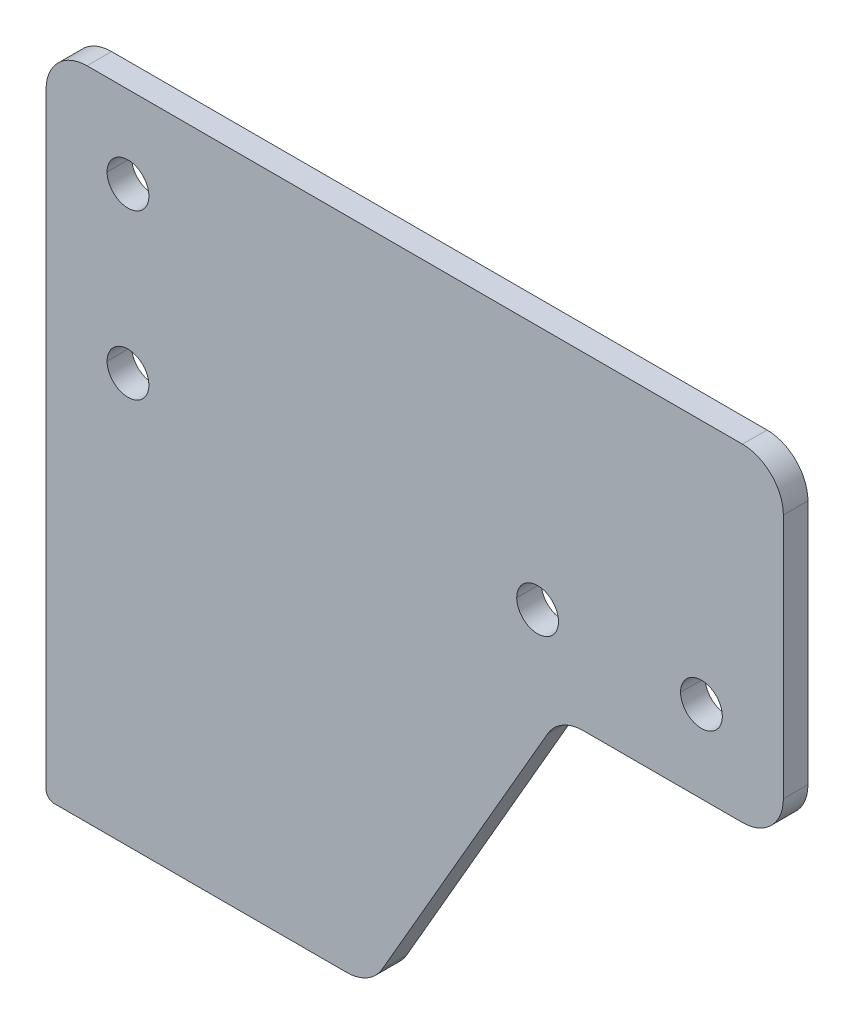
ISO-10303-21;
HEADER;
FILE_DESCRIPTION(('STEP AP214'),'2;1');
FILE_NAME('part.step','',(''),(''),'','','');
FILE_SCHEMA(('AUTOMOTIVE_DESIGN { 1 0 10303 214 1 1 1 1 }'));
ENDSEC;
DATA;
#1=APPLICATION_CONTEXT('core data for automotive mechanical design processes');
#2=APPLICATION_PROTOCOL_DEFINITION('international standard','automotive_design',2000,#1);
#3=PRODUCT_CONTEXT('',#1,'mechanical');
#4=PRODUCT('Part','Part','',(#3));
#5=PRODUCT_RELATED_PRODUCT_CATEGORY('part','',(#4));
#6=PRODUCT_DEFINITION_FORMATION('','',#4);
#7=PRODUCT_DEFINITION_CONTEXT('part definition',#1,'design');
#8=PRODUCT_DEFINITION('design','',#6,#7);
#9=PRODUCT_DEFINITION_SHAPE('','',#8);
#10=(LENGTH_UNIT() NAMED_UNIT(*) SI_UNIT(.MILLI.,.METRE.));
#11=(NAMED_UNIT(*) PLANE_ANGLE_UNIT() SI_UNIT($,.RADIAN.));
#12=(NAMED_UNIT(*) SI_UNIT($,.STERADIAN.) SOLID_ANGLE_UNIT());
#13=UNCERTAINTY_MEASURE_WITH_UNIT(LENGTH_MEASURE(1.E-05),#10,'distance_accuracy_value','');
#14=(GEOMETRIC_REPRESENTATION_CONTEXT(3) GLOBAL_UNCERTAINTY_ASSIGNED_CONTEXT((#13)) GLOBAL_UNIT_ASSIGNED_CONTEXT((#10,
#11,#12)) REPRESENTATION_CONTEXT('',''));
#15=CARTESIAN_POINT('',(0.,0.,0.));
#16=DIRECTION('',(0.,0.,1.));
#17=DIRECTION('',(1.,0.,0.));
#18=AXIS2_PLACEMENT_3D('',#15,#16,#17);
#19=CARTESIAN_POINT('',(35.,-111.435775775645,3.));
#20=DIRECTION('',(0.,0.,-1.));
#21=DIRECTION('',(-1.,0.,0.));
#22=AXIS2_PLACEMENT_3D('',#19,#20,#21);
#23=CYLINDRICAL_SURFACE('',#22,2.55);
#24=DIRECTION('',(0.,0.,-1.));
#25=VECTOR('',#24,1.);
#26=CARTESIAN_POINT('',(37.55,-111.435775775645,3.));
#27=LINE('',#26,#25);
#28=CARTESIAN_POINT('',(37.55,-111.435775775645,3.));
#29=VERTEX_POINT('',#28);
#30=CARTESIAN_POINT('',(37.55,-111.435775775645,0.));
#31=VERTEX_POINT('',#30);
#32=EDGE_CURVE('E461',#29,#31,#27,.T.);
#33=ORIENTED_EDGE('',*,*,#32,.F.);
#34=CARTESIAN_POINT('',(35.,-111.435775775645,3.));
#35=DIRECTION('',(0.,0.,1.));
#36=DIRECTION('',(-1.,0.,0.));
#37=AXIS2_PLACEMENT_3D('',#34,#35,#36);
#38=CIRCLE('',#37,2.55);
#39=CARTESIAN_POINT('',(32.45,-111.435775775645,3.));
#40=VERTEX_POINT('',#39);
#41=EDGE_CURVE('E323',#29,#40,#38,.T.);
#42=ORIENTED_EDGE('',*,*,#41,.T.);
#43=DIRECTION('',(0.,0.,-1.));
#44=VECTOR('',#43,1.);
#45=CARTESIAN_POINT('',(32.45,-111.435775775645,3.));
#46=LINE('',#45,#44);
#47=CARTESIAN_POINT('',(32.45,-111.435775775645,0.));
#48=VERTEX_POINT('',#47);
#49=EDGE_CURVE('E241',#40,#48,#46,.T.);
#50=ORIENTED_EDGE('',*,*,#49,.T.);
#51=CARTESIAN_POINT('',(35.,-111.435775775645,0.));
#52=DIRECTION('',(0.,0.,1.));
#53=DIRECTION('',(-1.,0.,0.));
#54=AXIS2_PLACEMENT_3D('',#51,#52,#53);
#55=CIRCLE('',#54,2.55);
#56=EDGE_CURVE('E360',#31,#48,#55,.T.);
#57=ORIENTED_EDGE('',*,*,#56,.F.);
#58=EDGE_LOOP('',(#33,#42,#50,#57));
#59=FACE_BOUND('',#58,.T.);
#60=ADVANCED_FACE('F17',(#59),#23,.F.);
#61=CARTESIAN_POINT('',(15.,-111.435775775645,3.));
#62=DIRECTION('',(0.,0.,-1.));
#63=DIRECTION('',(-1.,0.,0.));
#64=AXIS2_PLACEMENT_3D('',#61,#62,#63);
#65=CYLINDRICAL_SURFACE('',#64,2.55);
#66=DIRECTION('',(0.,0.,-1.));
#67=VECTOR('',#66,1.);
#68=CARTESIAN_POINT('',(17.55,-111.435775775645,3.));
#69=LINE('',#68,#67);
#70=CARTESIAN_POINT('',(17.55,-111.435775775645,3.));
#71=VERTEX_POINT('',#70);
#72=CARTESIAN_POINT('',(17.55,-111.435775775645,0.));
#73=VERTEX_POINT('',#72);
#74=EDGE_CURVE('E253',#71,#73,#69,.T.);
#75=ORIENTED_EDGE('',*,*,#74,.F.);
#76=CARTESIAN_POINT('',(15.,-111.435775775645,3.));
#77=DIRECTION('',(0.,0.,1.));
#78=DIRECTION('',(-1.,0.,0.));
#79=AXIS2_PLACEMENT_3D('',#76,#77,#78);
#80=CIRCLE('',#79,2.55);
#81=CARTESIAN_POINT('',(12.45,-111.435775775645,3.));
#82=VERTEX_POINT('',#81);
#83=EDGE_CURVE('E213',#71,#82,#80,.T.);
#84=ORIENTED_EDGE('',*,*,#83,.T.);
#85=DIRECTION('',(0.,0.,-1.));
#86=VECTOR('',#85,1.);
#87=CARTESIAN_POINT('',(12.45,-111.435775775645,3.));
#88=LINE('',#87,#86);
#89=CARTESIAN_POINT('',(12.45,-111.435775775645,0.));
#90=VERTEX_POINT('',#89);
#91=EDGE_CURVE('E265',#82,#90,#88,.T.);
#92=ORIENTED_EDGE('',*,*,#91,.T.);
#93=CARTESIAN_POINT('',(15.,-111.435775775645,0.));
#94=DIRECTION('',(0.,0.,1.));
#95=DIRECTION('',(-1.,0.,0.));
#96=AXIS2_PLACEMENT_3D('',#93,#94,#95);
#97=CIRCLE('',#96,2.55);
#98=EDGE_CURVE('E381',#73,#90,#97,.T.);
#99=ORIENTED_EDGE('',*,*,#98,.F.);
#100=EDGE_LOOP('',(#75,#84,#92,#99));
#101=FACE_BOUND('',#100,.T.);
#102=ADVANCED_FACE('F503',(#101),#65,.F.);
#103=CARTESIAN_POINT('',(-35.,-91.4357757756449,3.));
#104=DIRECTION('',(0.,0.,-1.));
#105=DIRECTION('',(-1.,0.,0.));
#106=AXIS2_PLACEMENT_3D('',#103,#104,#105);
#107=CYLINDRICAL_SURFACE('',#106,2.55);
#108=DIRECTION('',(0.,0.,-1.));
#109=VECTOR('',#108,1.);
#110=CARTESIAN_POINT('',(-32.45,-91.4357757756449,3.));
#111=LINE('',#110,#109);
#112=CARTESIAN_POINT('',(-32.45,-91.4357757756449,3.));
#113=VERTEX_POINT('',#112);
#114=CARTESIAN_POINT('',(-32.45,-91.4357757756449,0.));
#115=VERTEX_POINT('',#114);
#116=EDGE_CURVE('E264',#113,#115,#111,.T.);
#117=ORIENTED_EDGE('',*,*,#116,.F.);
#118=CARTESIAN_POINT('',(-35.,-91.4357757756449,3.));
#119=DIRECTION('',(0.,0.,1.));
#120=DIRECTION('',(-1.,0.,0.));
#121=AXIS2_PLACEMENT_3D('',#118,#119,#120);
#122=CIRCLE('',#121,2.55);
#123=CARTESIAN_POINT('',(-37.55,-91.4357757756449,3.));
#124=VERTEX_POINT('',#123);
#125=EDGE_CURVE('E212',#113,#124,#122,.T.);
#126=ORIENTED_EDGE('',*,*,#125,.T.);
#127=DIRECTION('',(0.,0.,-1.));
#128=VECTOR('',#127,1.);
#129=CARTESIAN_POINT('',(-37.55,-91.4357757756449,3.));
#130=LINE('',#129,#128);
#131=CARTESIAN_POINT('',(-37.55,-91.4357757756449,0.));
#132=VERTEX_POINT('',#131);
#133=EDGE_CURVE('E228',#124,#132,#130,.T.);
#134=ORIENTED_EDGE('',*,*,#133,.T.);
#135=CARTESIAN_POINT('',(-35.,-91.4357757756449,0.));
#136=DIRECTION('',(0.,0.,1.));
#137=DIRECTION('',(-1.,0.,0.));
#138=AXIS2_PLACEMENT_3D('',#135,#136,#137);
#139=CIRCLE('',#138,2.55);
#140=EDGE_CURVE('E364',#115,#132,#139,.T.);
#141=ORIENTED_EDGE('',*,*,#140,.F.);
#142=EDGE_LOOP('',(#117,#126,#134,#141));
#143=FACE_BOUND('',#142,.T.);
#144=ADVANCED_FACE('F490',(#143),#107,.F.);
#145=CARTESIAN_POINT('',(-35.,-111.435775775645,3.));
#146=DIRECTION('',(0.,0.,-1.));
#147=DIRECTION('',(-1.,0.,0.));
#148=AXIS2_PLACEMENT_3D('',#145,#146,#147);
#149=CYLINDRICAL_SURFACE('',#148,2.55);
#150=DIRECTION('',(0.,0.,-1.));
#151=VECTOR('',#150,1.);
#152=CARTESIAN_POINT('',(-32.45,-111.435775775645,3.));
#153=LINE('',#152,#151);
#154=CARTESIAN_POINT('',(-32.45,-111.435775775645,3.));
#155=VERTEX_POINT('',#154);
#156=CARTESIAN_POINT('',(-32.45,-111.435775775645,0.));
#157=VERTEX_POINT('',#156);
#158=EDGE_CURVE('E216',#155,#157,#153,.T.);
#159=ORIENTED_EDGE('',*,*,#158,.F.);
#160=CARTESIAN_POINT('',(-35.,-111.435775775645,3.));
#161=DIRECTION('',(0.,0.,1.));
#162=DIRECTION('',(-1.,0.,0.));
#163=AXIS2_PLACEMENT_3D('',#160,#161,#162);
#164=CIRCLE('',#163,2.55);
#165=CARTESIAN_POINT('',(-37.55,-111.435775775645,3.));
#166=VERTEX_POINT('',#165);
#167=EDGE_CURVE('E202',#155,#166,#164,.T.);
#168=ORIENTED_EDGE('',*,*,#167,.T.);
#169=DIRECTION('',(0.,0.,-1.));
#170=VECTOR('',#169,1.);
#171=CARTESIAN_POINT('',(-37.55,-111.435775775645,3.));
#172=LINE('',#171,#170);
#173=CARTESIAN_POINT('',(-37.55,-111.435775775645,0.));
#174=VERTEX_POINT('',#173);
#175=EDGE_CURVE('E226',#166,#174,#172,.T.);
#176=ORIENTED_EDGE('',*,*,#175,.T.);
#177=CARTESIAN_POINT('',(-35.,-111.435775775645,0.));
#178=DIRECTION('',(0.,0.,1.));
#179=DIRECTION('',(-1.,0.,0.));
#180=AXIS2_PLACEMENT_3D('',#177,#178,#179);
#181=CIRCLE('',#180,2.55);
#182=EDGE_CURVE('E218',#157,#174,#181,.T.);
#183=ORIENTED_EDGE('',*,*,#182,.F.);
#184=EDGE_LOOP('',(#159,#168,#176,#183));
#185=FACE_BOUND('',#184,.T.);
#186=ADVANCED_FACE('F217',(#185),#149,.F.);
#187=CARTESIAN_POINT('',(40.,-81.4357757756449,3.));
#188=DIRECTION('',(0.,-1.,0.));
#189=DIRECTION('',(-1.,0.,0.));
#190=AXIS2_PLACEMENT_3D('',#187,#188,#189);
#191=PLANE('',#190);
#192=DIRECTION('',(-1.,0.,0.));
#193=VECTOR('',#192,1.);
#194=CARTESIAN_POINT('',(40.,-81.4357757756449,0.));
#195=LINE('',#194,#193);
#196=CARTESIAN_POINT('',(40.,-81.4357757756449,0.));
#197=VERTEX_POINT('',#196);
#198=CARTESIAN_POINT('',(-40.,-81.4357757756449,0.));
#199=VERTEX_POINT('',#198);
#200=EDGE_CURVE('E336',#197,#199,#195,.T.);
#201=ORIENTED_EDGE('',*,*,#200,.T.);
#202=DIRECTION('',(0.,0.,-1.));
#203=VECTOR('',#202,1.);
#204=CARTESIAN_POINT('',(-40.,-81.4357757756449,3.));
#205=LINE('',#204,#203);
#206=CARTESIAN_POINT('',(-40.,-81.4357757756449,3.));
#207=VERTEX_POINT('',#206);
#208=EDGE_CURVE('E388',#207,#199,#205,.T.);
#209=ORIENTED_EDGE('',*,*,#208,.F.);
#210=DIRECTION('',(-1.,0.,0.));
#211=VECTOR('',#210,1.);
#212=CARTESIAN_POINT('',(40.,-81.4357757756449,3.));
#213=LINE('',#212,#211);
#214=CARTESIAN_POINT('',(40.,-81.4357757756449,3.));
#215=VERTEX_POINT('',#214);
#216=EDGE_CURVE('E315',#215,#207,#213,.T.);
#217=ORIENTED_EDGE('',*,*,#216,.F.);
#218=DIRECTION('',(0.,0.,-1.));
#219=VECTOR('',#218,1.);
#220=CARTESIAN_POINT('',(40.,-81.4357757756449,3.));
#221=LINE('',#220,#219);
#222=EDGE_CURVE('E11',#215,#197,#221,.T.);
#223=ORIENTED_EDGE('',*,*,#222,.T.);
#224=EDGE_LOOP('',(#201,#209,#217,#223));
#225=FACE_BOUND('',#224,.T.);
#226=ADVANCED_FACE('F514',(#225),#191,.F.);
#227=CARTESIAN_POINT('',(40.,-86.4357757756449,3.));
#228=DIRECTION('',(0.,0.,-1.));
#229=DIRECTION('',(-1.,0.,0.));
#230=AXIS2_PLACEMENT_3D('',#227,#228,#229);
#231=CYLINDRICAL_SURFACE('',#230,5.);
#232=CARTESIAN_POINT('',(40.,-86.4357757756449,0.));
#233=DIRECTION('',(0.,0.,1.));
#234=DIRECTION('',(1.,0.,0.));
#235=AXIS2_PLACEMENT_3D('',#232,#233,#234);
#236=CIRCLE('',#235,5.);
#237=CARTESIAN_POINT('',(45.,-86.435775775645,0.));
#238=VERTEX_POINT('',#237);
#239=EDGE_CURVE('E340',#238,#197,#236,.T.);
#240=ORIENTED_EDGE('',*,*,#239,.T.);
#241=ORIENTED_EDGE('',*,*,#222,.F.);
#242=CARTESIAN_POINT('',(40.,-86.4357757756449,3.));
#243=DIRECTION('',(0.,0.,1.));
#244=DIRECTION('',(1.,0.,0.));
#245=AXIS2_PLACEMENT_3D('',#242,#243,#244);
#246=CIRCLE('',#245,5.);
#247=CARTESIAN_POINT('',(45.,-86.435775775645,3.));
#248=VERTEX_POINT('',#247);
#249=EDGE_CURVE('E311',#248,#215,#246,.T.);
#250=ORIENTED_EDGE('',*,*,#249,.F.);
#251=DIRECTION('',(0.,0.,-1.));
#252=VECTOR('',#251,1.);
#253=CARTESIAN_POINT('',(45.,-86.435775775645,3.));
#254=LINE('',#253,#252);
#255=EDGE_CURVE('E25',#248,#238,#254,.T.);
#256=ORIENTED_EDGE('',*,*,#255,.T.);
#257=EDGE_LOOP('',(#240,#241,#250,#256));
#258=FACE_BOUND('',#257,.T.);
#259=ADVANCED_FACE('F422',(#258),#231,.T.);
#260=CARTESIAN_POINT('',(45.,-116.435775775645,3.));
#261=DIRECTION('',(-1.,0.,0.));
#262=DIRECTION('',(0.,0.,1.));
#263=AXIS2_PLACEMENT_3D('',#260,#261,#262);
#264=PLANE('',#263);
#265=DIRECTION('',(0.,1.,0.));
#266=VECTOR('',#265,1.);
#267=CARTESIAN_POINT('',(45.,-116.435775775645,0.));
#268=LINE('',#267,#266);
#269=CARTESIAN_POINT('',(45.,-116.435775775645,0.));
#270=VERTEX_POINT('',#269);
#271=EDGE_CURVE('E332',#270,#238,#268,.T.);
#272=ORIENTED_EDGE('',*,*,#271,.T.);
#273=ORIENTED_EDGE('',*,*,#255,.F.);
#274=DIRECTION('',(0.,1.,0.));
#275=VECTOR('',#274,1.);
#276=CARTESIAN_POINT('',(45.,-116.435775775645,3.));
#277=LINE('',#276,#275);
#278=CARTESIAN_POINT('',(45.,-116.435775775645,3.));
#279=VERTEX_POINT('',#278);
#280=EDGE_CURVE('E307',#279,#248,#277,.T.);
#281=ORIENTED_EDGE('',*,*,#280,.F.);
#282=DIRECTION('',(0.,0.,-1.));
#283=VECTOR('',#282,1.);
#284=CARTESIAN_POINT('',(45.,-116.435775775645,3.));
#285=LINE('',#284,#283);
#286=EDGE_CURVE('E248',#279,#270,#285,.T.);
#287=ORIENTED_EDGE('',*,*,#286,.T.);
#288=EDGE_LOOP('',(#272,#273,#281,#287));
#289=FACE_BOUND('',#288,.T.);
#290=ADVANCED_FACE('F409',(#289),#264,.F.);
#291=CARTESIAN_POINT('',(40.,-116.435775775645,3.));
#292=DIRECTION('',(0.,0.,-1.));
#293=DIRECTION('',(-1.,0.,0.));
#294=AXIS2_PLACEMENT_3D('',#291,#292,#293);
#295=CYLINDRICAL_SURFACE('',#294,5.);
#296=CARTESIAN_POINT('',(40.,-116.435775775645,0.));
#297=DIRECTION('',(0.,0.,1.));
#298=DIRECTION('',(-1.,0.,0.));
#299=AXIS2_PLACEMENT_3D('',#296,#297,#298);
#300=CIRCLE('',#299,5.);
#301=CARTESIAN_POINT('',(40.,-121.435775775645,0.));
#302=VERTEX_POINT('',#301);
#303=EDGE_CURVE('E327',#302,#270,#300,.T.);
#304=ORIENTED_EDGE('',*,*,#303,.T.);
#305=ORIENTED_EDGE('',*,*,#286,.F.);
#306=CARTESIAN_POINT('',(40.,-116.435775775645,3.));
#307=DIRECTION('',(0.,0.,1.));
#308=DIRECTION('',(-1.,0.,0.));
#309=AXIS2_PLACEMENT_3D('',#306,#307,#308);
#310=CIRCLE('',#309,5.);
#311=CARTESIAN_POINT('',(40.,-121.435775775645,3.));
#312=VERTEX_POINT('',#311);
#313=EDGE_CURVE('E303',#312,#279,#310,.T.);
#314=ORIENTED_EDGE('',*,*,#313,.F.);
#315=DIRECTION('',(0.,0.,-1.));
#316=VECTOR('',#315,1.);
#317=CARTESIAN_POINT('',(40.,-121.435775775645,3.));
#318=LINE('',#317,#316);
#319=EDGE_CURVE('E402',#312,#302,#318,.T.);
#320=ORIENTED_EDGE('',*,*,#319,.T.);
#321=EDGE_LOOP('',(#304,#305,#314,#320));
#322=FACE_BOUND('',#321,.T.);
#323=ADVANCED_FACE('F415',(#322),#295,.T.);
#324=CARTESIAN_POINT('',(40.,-121.435775775645,3.));
#325=DIRECTION('',(0.,1.,0.));
#326=DIRECTION('',(1.,0.,0.));
#327=AXIS2_PLACEMENT_3D('',#324,#325,#326);
#328=PLANE('',#327);
#329=DIRECTION('',(1.,0.,0.));
#330=VECTOR('',#329,1.);
#331=CARTESIAN_POINT('',(40.,-121.435775775645,0.));
#332=LINE('',#331,#330);
#333=CARTESIAN_POINT('',(20.55857957375,-121.435775775645,0.));
#334=VERTEX_POINT('',#333);
#335=EDGE_CURVE('E331',#334,#302,#332,.T.);
#336=ORIENTED_EDGE('',*,*,#335,.T.);
#337=ORIENTED_EDGE('',*,*,#319,.F.);
#338=DIRECTION('',(1.,0.,0.));
#339=VECTOR('',#338,1.);
#340=CARTESIAN_POINT('',(40.,-121.435775775645,3.));
#341=LINE('',#340,#339);
#342=CARTESIAN_POINT('',(20.55857957375,-121.435775775645,3.));
#343=VERTEX_POINT('',#342);
#344=EDGE_CURVE('E299',#343,#312,#341,.T.);
#345=ORIENTED_EDGE('',*,*,#344,.F.);
#346=DIRECTION('',(0.,0.,-1.));
#347=VECTOR('',#346,1.);
#348=CARTESIAN_POINT('',(20.55857957375,-121.435775775645,3.));
#349=LINE('',#348,#347);
#350=EDGE_CURVE('E354',#343,#334,#349,.T.);
#351=ORIENTED_EDGE('',*,*,#350,.T.);
#352=EDGE_LOOP('',(#336,#337,#345,#351));
#353=FACE_BOUND('',#352,.T.);
#354=ADVANCED_FACE('F429',(#353),#328,.F.);
#355=CARTESIAN_POINT('',(20.55857957375,-126.435775775645,3.));
#356=DIRECTION('',(0.,0.,-1.));
#357=DIRECTION('',(-1.,0.,0.));
#358=AXIS2_PLACEMENT_3D('',#355,#356,#357);
#359=CYLINDRICAL_SURFACE('',#358,5.);
#360=CARTESIAN_POINT('',(20.55857957375,-126.435775775645,0.));
#361=DIRECTION('',(0.,0.,-1.));
#362=DIRECTION('',(-1.,0.,0.));
#363=AXIS2_PLACEMENT_3D('',#360,#361,#362);
#364=CIRCLE('',#363,5.);
#365=CARTESIAN_POINT('',(16.2284525548279,-123.935775775645,0.));
#366=VERTEX_POINT('',#365);
#367=EDGE_CURVE('E350',#366,#334,#364,.T.);
#368=ORIENTED_EDGE('',*,*,#367,.T.);
#369=ORIENTED_EDGE('',*,*,#350,.F.);
#370=CARTESIAN_POINT('',(20.55857957375,-126.435775775645,3.));
#371=DIRECTION('',(0.,0.,-1.));
#372=DIRECTION('',(-1.,0.,0.));
#373=AXIS2_PLACEMENT_3D('',#370,#371,#372);
#374=CIRCLE('',#373,5.);
#375=CARTESIAN_POINT('',(16.2284525548279,-123.935775775645,3.));
#376=VERTEX_POINT('',#375);
#377=EDGE_CURVE('E295',#376,#343,#374,.T.);
#378=ORIENTED_EDGE('',*,*,#377,.F.);
#379=DIRECTION('',(0.,0.,-1.));
#380=VECTOR('',#379,1.);
#381=CARTESIAN_POINT('',(16.2284525548279,-123.935775775645,3.));
#382=LINE('',#381,#380);
#383=EDGE_CURVE('E351',#376,#366,#382,.T.);
#384=ORIENTED_EDGE('',*,*,#383,.T.);
#385=EDGE_LOOP('',(#368,#369,#378,#384));
#386=FACE_BOUND('',#385,.T.);
#387=ADVANCED_FACE('F434',(#386),#359,.F.);
#388=CARTESIAN_POINT('',(16.2284525548279,-123.935775775645,3.));
#389=DIRECTION('',(-0.866025403784436,0.5,0.));
#390=DIRECTION('',(0.,0.,1.));
#391=AXIS2_PLACEMENT_3D('',#388,#389,#390);
#392=PLANE('',#391);
#393=DIRECTION('',(0.5,0.866025403784436,0.));
#394=VECTOR('',#393,1.);
#395=CARTESIAN_POINT('',(16.2284525548279,-123.935775775645,0.));
#396=LINE('',#395,#394);
#397=CARTESIAN_POINT('',(-3.97880686680929,-158.935775775645,0.));
#398=VERTEX_POINT('',#397);
#399=EDGE_CURVE('E359',#398,#366,#396,.T.);
#400=ORIENTED_EDGE('',*,*,#399,.T.);
#401=ORIENTED_EDGE('',*,*,#383,.F.);
#402=DIRECTION('',(0.5,0.866025403784436,0.));
#403=VECTOR('',#402,1.);
#404=CARTESIAN_POINT('',(16.2284525548279,-123.935775775645,3.));
#405=LINE('',#404,#403);
#406=CARTESIAN_POINT('',(-3.97880686680929,-158.935775775645,3.));
#407=VERTEX_POINT('',#406);
#408=EDGE_CURVE('E258',#407,#376,#405,.T.);
#409=ORIENTED_EDGE('',*,*,#408,.F.);
#410=DIRECTION('',(0.,0.,-1.));
#411=VECTOR('',#410,1.);
#412=CARTESIAN_POINT('',(-3.97880686680929,-158.935775775645,3.));
#413=LINE('',#412,#411);
#414=EDGE_CURVE('E355',#407,#398,#413,.T.);
#415=ORIENTED_EDGE('',*,*,#414,.T.);
#416=EDGE_LOOP('',(#400,#401,#409,#415));
#417=FACE_BOUND('',#416,.T.);
#418=ADVANCED_FACE('F437',(#417),#392,.F.);
#419=CARTESIAN_POINT('',(-8.30893388573148,-156.435775775645,3.));
#420=DIRECTION('',(0.,0.,-1.));
#421=DIRECTION('',(-1.,0.,0.));
#422=AXIS2_PLACEMENT_3D('',#419,#420,#421);
#423=CYLINDRICAL_SURFACE('',#422,5.);
#424=CARTESIAN_POINT('',(-8.30893388573148,-156.435775775645,0.));
#425=DIRECTION('',(0.,0.,1.));
#426=DIRECTION('',(-1.,0.,0.));
#427=AXIS2_PLACEMENT_3D('',#424,#425,#426);
#428=CIRCLE('',#427,5.);
#429=CARTESIAN_POINT('',(-8.30893388573151,-161.435775775645,0.));
#430=VERTEX_POINT('',#429);
#431=EDGE_CURVE('E368',#430,#398,#428,.T.);
#432=ORIENTED_EDGE('',*,*,#431,.T.);
#433=ORIENTED_EDGE('',*,*,#414,.F.);
#434=CARTESIAN_POINT('',(-8.30893388573148,-156.435775775645,3.));
#435=DIRECTION('',(0.,0.,1.));
#436=DIRECTION('',(-1.,0.,0.));
#437=AXIS2_PLACEMENT_3D('',#434,#435,#436);
#438=CIRCLE('',#437,5.);
#439=CARTESIAN_POINT('',(-8.30893388573151,-161.435775775645,3.));
#440=VERTEX_POINT('',#439);
#441=EDGE_CURVE('E254',#440,#407,#438,.T.);
#442=ORIENTED_EDGE('',*,*,#441,.F.);
#443=DIRECTION('',(0.,0.,-1.));
#444=VECTOR('',#443,1.);
#445=CARTESIAN_POINT('',(-8.30893388573151,-161.435775775645,3.));
#446=LINE('',#445,#444);
#447=EDGE_CURVE('E393',#440,#430,#446,.T.);
#448=ORIENTED_EDGE('',*,*,#447,.T.);
#449=EDGE_LOOP('',(#432,#433,#442,#448));
#450=FACE_BOUND('',#449,.T.);
#451=ADVANCED_FACE('F440',(#450),#423,.T.);
#452=CARTESIAN_POINT('',(-44.,-161.435775775645,3.));
#453=DIRECTION('',(0.,1.,0.));
#454=DIRECTION('',(1.,0.,0.));
#455=AXIS2_PLACEMENT_3D('',#452,#453,#454);
#456=PLANE('',#455);
#457=DIRECTION('',(1.,0.,0.));
#458=VECTOR('',#457,1.);
#459=CARTESIAN_POINT('',(-44.,-161.435775775645,0.));
#460=LINE('',#459,#458);
#461=CARTESIAN_POINT('',(-44.,-161.435775775645,0.));
#462=VERTEX_POINT('',#461);
#463=EDGE_CURVE('E372',#462,#430,#460,.T.);
#464=ORIENTED_EDGE('',*,*,#463,.T.);
#465=ORIENTED_EDGE('',*,*,#447,.F.);
#466=DIRECTION('',(1.,0.,0.));
#467=VECTOR('',#466,1.);
#468=CARTESIAN_POINT('',(-44.,-161.435775775645,3.));
#469=LINE('',#468,#467);
#470=CARTESIAN_POINT('',(-44.,-161.435775775645,3.));
#471=VERTEX_POINT('',#470);
#472=EDGE_CURVE('E259',#471,#440,#469,.T.);
#473=ORIENTED_EDGE('',*,*,#472,.F.);
#474=DIRECTION('',(0.,0.,-1.));
#475=VECTOR('',#474,1.);
#476=CARTESIAN_POINT('',(-44.,-161.435775775645,3.));
#477=LINE('',#476,#475);
#478=EDGE_CURVE('E49',#471,#462,#477,.T.);
#479=ORIENTED_EDGE('',*,*,#478,.T.);
#480=EDGE_LOOP('',(#464,#465,#473,#479));
#481=FACE_BOUND('',#480,.T.);
#482=ADVANCED_FACE('F444',(#481),#456,.F.);
#483=CARTESIAN_POINT('',(-44.,-160.435775775645,3.));
#484=DIRECTION('',(0.,0.,-1.));
#485=DIRECTION('',(-1.,0.,0.));
#486=AXIS2_PLACEMENT_3D('',#483,#484,#485);
#487=CYLINDRICAL_SURFACE('',#486,1.);
#488=CARTESIAN_POINT('',(-44.,-160.435775775645,0.));
#489=DIRECTION('',(0.,0.,1.));
#490=DIRECTION('',(1.,0.,0.));
#491=AXIS2_PLACEMENT_3D('',#488,#489,#490);
#492=CIRCLE('',#491,1.);
#493=CARTESIAN_POINT('',(-45.,-160.435775775645,0.));
#494=VERTEX_POINT('',#493);
#495=EDGE_CURVE('E375',#494,#462,#492,.T.);
#496=ORIENTED_EDGE('',*,*,#495,.T.);
#497=ORIENTED_EDGE('',*,*,#478,.F.);
#498=CARTESIAN_POINT('',(-44.,-160.435775775645,3.));
#499=DIRECTION('',(0.,0.,1.));
#500=DIRECTION('',(1.,0.,0.));
#501=AXIS2_PLACEMENT_3D('',#498,#499,#500);
#502=CIRCLE('',#501,1.);
#503=CARTESIAN_POINT('',(-45.,-160.435775775645,3.));
#504=VERTEX_POINT('',#503);
#505=EDGE_CURVE('E239',#504,#471,#502,.T.);
#506=ORIENTED_EDGE('',*,*,#505,.F.);
#507=DIRECTION('',(0.,0.,-1.));
#508=VECTOR('',#507,1.);
#509=CARTESIAN_POINT('',(-45.,-160.435775775645,3.));
#510=LINE('',#509,#508);
#511=EDGE_CURVE('E38',#504,#494,#510,.T.);
#512=ORIENTED_EDGE('',*,*,#511,.T.);
#513=EDGE_LOOP('',(#496,#497,#506,#512));
#514=FACE_BOUND('',#513,.T.);
#515=ADVANCED_FACE('F528',(#514),#487,.T.);
#516=CARTESIAN_POINT('',(-45.,-160.435775775645,3.));
#517=DIRECTION('',(1.,0.,0.));
#518=DIRECTION('',(0.,-1.,0.));
#519=AXIS2_PLACEMENT_3D('',#516,#517,#518);
#520=PLANE('',#519);
#521=DIRECTION('',(0.,-1.,0.));
#522=VECTOR('',#521,1.);
#523=CARTESIAN_POINT('',(-45.,-160.435775775645,0.));
#524=LINE('',#523,#522);
#525=CARTESIAN_POINT('',(-45.,-86.435775775645,0.));
#526=VERTEX_POINT('',#525);
#527=EDGE_CURVE('E378',#526,#494,#524,.T.);
#528=ORIENTED_EDGE('',*,*,#527,.T.);
#529=ORIENTED_EDGE('',*,*,#511,.F.);
#530=DIRECTION('',(0.,-1.,0.));
#531=VECTOR('',#530,1.);
#532=CARTESIAN_POINT('',(-45.,-160.435775775645,3.));
#533=LINE('',#532,#531);
#534=CARTESIAN_POINT('',(-45.,-86.435775775645,3.));
#535=VERTEX_POINT('',#534);
#536=EDGE_CURVE('E288',#535,#504,#533,.T.);
#537=ORIENTED_EDGE('',*,*,#536,.F.);
#538=DIRECTION('',(0.,0.,-1.));
#539=VECTOR('',#538,1.);
#540=CARTESIAN_POINT('',(-45.,-86.435775775645,3.));
#541=LINE('',#540,#539);
#542=EDGE_CURVE('E363',#535,#526,#541,.T.);
#543=ORIENTED_EDGE('',*,*,#542,.T.);
#544=EDGE_LOOP('',(#528,#529,#537,#543));
#545=FACE_BOUND('',#544,.T.);
#546=ADVANCED_FACE('F530',(#545),#520,.F.);
#547=CARTESIAN_POINT('',(-40.,-86.4357757756449,3.));
#548=DIRECTION('',(0.,0.,-1.));
#549=DIRECTION('',(-1.,0.,0.));
#550=AXIS2_PLACEMENT_3D('',#547,#548,#549);
#551=CYLINDRICAL_SURFACE('',#550,5.);
#552=CARTESIAN_POINT('',(-40.,-86.4357757756449,0.));
#553=DIRECTION('',(0.,0.,1.));
#554=DIRECTION('',(-1.,0.,0.));
#555=AXIS2_PLACEMENT_3D('',#552,#553,#554);
#556=CIRCLE('',#555,5.);
#557=EDGE_CURVE('E326',#199,#526,#556,.T.);
#558=ORIENTED_EDGE('',*,*,#557,.T.);
#559=ORIENTED_EDGE('',*,*,#542,.F.);
#560=CARTESIAN_POINT('',(-40.,-86.4357757756449,3.));
#561=DIRECTION('',(0.,0.,1.));
#562=DIRECTION('',(-1.,0.,0.));
#563=AXIS2_PLACEMENT_3D('',#560,#561,#562);
#564=CIRCLE('',#563,5.);
#565=EDGE_CURVE('E284',#207,#535,#564,.T.);
#566=ORIENTED_EDGE('',*,*,#565,.F.);
#567=ORIENTED_EDGE('',*,*,#208,.T.);
#568=EDGE_LOOP('',(#558,#559,#566,#567));
#569=FACE_BOUND('',#568,.T.);
#570=ADVANCED_FACE('F493',(#569),#551,.T.);
#571=CARTESIAN_POINT('',(-40.,-86.4357757756449,0.));
#572=DIRECTION('',(0.,0.,-1.));
#573=DIRECTION('',(0.,-1.,0.));
#574=AXIS2_PLACEMENT_3D('',#571,#572,#573);
#575=PLANE('',#574);
#576=CARTESIAN_POINT('',(35.,-111.435775775645,0.));
#577=DIRECTION('',(0.,0.,1.));
#578=DIRECTION('',(-1.,0.,0.));
#579=AXIS2_PLACEMENT_3D('',#576,#577,#578);
#580=CIRCLE('',#579,2.55);
#581=EDGE_CURVE('E246',#48,#31,#580,.T.);
#582=ORIENTED_EDGE('',*,*,#581,.T.);
#583=ORIENTED_EDGE('',*,*,#56,.T.);
#584=EDGE_LOOP('',(#582,#583));
#585=FACE_BOUND('',#584,.T.);
#586=CARTESIAN_POINT('',(-35.,-91.4357757756449,0.));
#587=DIRECTION('',(0.,0.,1.));
#588=DIRECTION('',(-1.,0.,0.));
#589=AXIS2_PLACEMENT_3D('',#586,#587,#588);
#590=CIRCLE('',#589,2.55);
#591=EDGE_CURVE('E235',#132,#115,#590,.T.);
#592=ORIENTED_EDGE('',*,*,#591,.T.);
#593=ORIENTED_EDGE('',*,*,#140,.T.);
#594=EDGE_LOOP('',(#592,#593));
#595=FACE_BOUND('',#594,.T.);
#596=CARTESIAN_POINT('',(-35.,-111.435775775645,0.));
#597=DIRECTION('',(0.,0.,1.));
#598=DIRECTION('',(-1.,0.,0.));
#599=AXIS2_PLACEMENT_3D('',#596,#597,#598);
#600=CIRCLE('',#599,2.55);
#601=EDGE_CURVE('E223',#174,#157,#600,.T.);
#602=ORIENTED_EDGE('',*,*,#601,.T.);
#603=ORIENTED_EDGE('',*,*,#182,.T.);
#604=EDGE_LOOP('',(#602,#603));
#605=FACE_BOUND('',#604,.T.);
#606=CARTESIAN_POINT('',(15.,-111.435775775645,0.));
#607=DIRECTION('',(0.,0.,1.));
#608=DIRECTION('',(-1.,0.,0.));
#609=AXIS2_PLACEMENT_3D('',#606,#607,#608);
#610=CIRCLE('',#609,2.55);
#611=EDGE_CURVE('E269',#90,#73,#610,.T.);
#612=ORIENTED_EDGE('',*,*,#611,.T.);
#613=ORIENTED_EDGE('',*,*,#98,.T.);
#614=EDGE_LOOP('',(#612,#613));
#615=FACE_BOUND('',#614,.T.);
#616=ORIENTED_EDGE('',*,*,#557,.F.);
#617=ORIENTED_EDGE('',*,*,#200,.F.);
#618=ORIENTED_EDGE('',*,*,#239,.F.);
#619=ORIENTED_EDGE('',*,*,#271,.F.);
#620=ORIENTED_EDGE('',*,*,#303,.F.);
#621=ORIENTED_EDGE('',*,*,#335,.F.);
#622=ORIENTED_EDGE('',*,*,#367,.F.);
#623=ORIENTED_EDGE('',*,*,#399,.F.);
#624=ORIENTED_EDGE('',*,*,#431,.F.);
#625=ORIENTED_EDGE('',*,*,#463,.F.);
#626=ORIENTED_EDGE('',*,*,#495,.F.);
#627=ORIENTED_EDGE('',*,*,#527,.F.);
#628=EDGE_LOOP('',(#616,#617,#618,#619,#620,#621,#622,#623,#624,#625,#626,#627));
#629=FACE_BOUND('',#628,.T.);
#630=ADVANCED_FACE('F419',(#585,#595,#605,#615,#629),#575,.T.);
#631=CARTESIAN_POINT('',(-40.,-86.4357757756449,3.));
#632=DIRECTION('',(0.,0.,-1.));
#633=DIRECTION('',(0.,-1.,0.));
#634=AXIS2_PLACEMENT_3D('',#631,#632,#633);
#635=PLANE('',#634);
#636=CARTESIAN_POINT('',(35.,-111.435775775645,3.));
#637=DIRECTION('',(0.,0.,1.));
#638=DIRECTION('',(-1.,0.,0.));
#639=AXIS2_PLACEMENT_3D('',#636,#637,#638);
#640=CIRCLE('',#639,2.55);
#641=EDGE_CURVE('E457',#40,#29,#640,.T.);
#642=ORIENTED_EDGE('',*,*,#641,.F.);
#643=ORIENTED_EDGE('',*,*,#41,.F.);
#644=EDGE_LOOP('',(#642,#643));
#645=FACE_BOUND('',#644,.T.);
#646=CARTESIAN_POINT('',(-35.,-91.4357757756449,3.));
#647=DIRECTION('',(0.,0.,1.));
#648=DIRECTION('',(-1.,0.,0.));
#649=AXIS2_PLACEMENT_3D('',#646,#647,#648);
#650=CIRCLE('',#649,2.55);
#651=EDGE_CURVE('E260',#124,#113,#650,.T.);
#652=ORIENTED_EDGE('',*,*,#651,.F.);
#653=ORIENTED_EDGE('',*,*,#125,.F.);
#654=EDGE_LOOP('',(#652,#653));
#655=FACE_BOUND('',#654,.T.);
#656=CARTESIAN_POINT('',(-35.,-111.435775775645,3.));
#657=DIRECTION('',(0.,0.,1.));
#658=DIRECTION('',(-1.,0.,0.));
#659=AXIS2_PLACEMENT_3D('',#656,#657,#658);
#660=CIRCLE('',#659,2.55);
#661=EDGE_CURVE('E207',#166,#155,#660,.T.);
#662=ORIENTED_EDGE('',*,*,#661,.F.);
#663=ORIENTED_EDGE('',*,*,#167,.F.);
#664=EDGE_LOOP('',(#662,#663));
#665=FACE_BOUND('',#664,.T.);
#666=CARTESIAN_POINT('',(15.,-111.435775775645,3.));
#667=DIRECTION('',(0.,0.,1.));
#668=DIRECTION('',(-1.,0.,0.));
#669=AXIS2_PLACEMENT_3D('',#666,#667,#668);
#670=CIRCLE('',#669,2.55);
#671=EDGE_CURVE('E245',#82,#71,#670,.T.);
#672=ORIENTED_EDGE('',*,*,#671,.F.);
#673=ORIENTED_EDGE('',*,*,#83,.F.);
#674=EDGE_LOOP('',(#672,#673));
#675=FACE_BOUND('',#674,.T.);
#676=ORIENTED_EDGE('',*,*,#565,.T.);
#677=ORIENTED_EDGE('',*,*,#536,.T.);
#678=ORIENTED_EDGE('',*,*,#505,.T.);
#679=ORIENTED_EDGE('',*,*,#472,.T.);
#680=ORIENTED_EDGE('',*,*,#441,.T.);
#681=ORIENTED_EDGE('',*,*,#408,.T.);
#682=ORIENTED_EDGE('',*,*,#377,.T.);
#683=ORIENTED_EDGE('',*,*,#344,.T.);
#684=ORIENTED_EDGE('',*,*,#313,.T.);
#685=ORIENTED_EDGE('',*,*,#280,.T.);
#686=ORIENTED_EDGE('',*,*,#249,.T.);
#687=ORIENTED_EDGE('',*,*,#216,.T.);
#688=EDGE_LOOP('',(#676,#677,#678,#679,#680,#681,#682,#683,#684,#685,#686,#687));
#689=FACE_BOUND('',#688,.T.);
#690=ADVANCED_FACE('F204',(#645,#655,#665,#675,#689),#635,.F.);
#691=CARTESIAN_POINT('',(-35.,-111.435775775645,3.));
#692=DIRECTION('',(0.,0.,-1.));
#693=DIRECTION('',(-1.,0.,0.));
#694=AXIS2_PLACEMENT_3D('',#691,#692,#693);
#695=CYLINDRICAL_SURFACE('',#694,2.55);
#696=ORIENTED_EDGE('',*,*,#661,.T.);
#697=ORIENTED_EDGE('',*,*,#158,.T.);
#698=ORIENTED_EDGE('',*,*,#601,.F.);
#699=ORIENTED_EDGE('',*,*,#175,.F.);
#700=EDGE_LOOP('',(#696,#697,#698,#699));
#701=FACE_BOUND('',#700,.T.);
#702=ADVANCED_FACE('F225',(#701),#695,.F.);
#703=CARTESIAN_POINT('',(-35.,-91.4357757756449,3.));
#704=DIRECTION('',(0.,0.,-1.));
#705=DIRECTION('',(-1.,0.,0.));
#706=AXIS2_PLACEMENT_3D('',#703,#704,#705);
#707=CYLINDRICAL_SURFACE('',#706,2.55);
#708=ORIENTED_EDGE('',*,*,#651,.T.);
#709=ORIENTED_EDGE('',*,*,#116,.T.);
#710=ORIENTED_EDGE('',*,*,#591,.F.);
#711=ORIENTED_EDGE('',*,*,#133,.F.);
#712=EDGE_LOOP('',(#708,#709,#710,#711));
#713=FACE_BOUND('',#712,.T.);
#714=ADVANCED_FACE('F487',(#713),#707,.F.);
#715=CARTESIAN_POINT('',(15.,-111.435775775645,3.));
#716=DIRECTION('',(0.,0.,-1.));
#717=DIRECTION('',(-1.,0.,0.));
#718=AXIS2_PLACEMENT_3D('',#715,#716,#717);
#719=CYLINDRICAL_SURFACE('',#718,2.55);
#720=ORIENTED_EDGE('',*,*,#671,.T.);
#721=ORIENTED_EDGE('',*,*,#74,.T.);
#722=ORIENTED_EDGE('',*,*,#611,.F.);
#723=ORIENTED_EDGE('',*,*,#91,.F.);
#724=EDGE_LOOP('',(#720,#721,#722,#723));
#725=FACE_BOUND('',#724,.T.);
#726=ADVANCED_FACE('F500',(#725),#719,.F.);
#727=CARTESIAN_POINT('',(35.,-111.435775775645,3.));
#728=DIRECTION('',(0.,0.,-1.));
#729=DIRECTION('',(-1.,0.,0.));
#730=AXIS2_PLACEMENT_3D('',#727,#728,#729);
#731=CYLINDRICAL_SURFACE('',#730,2.55);
#732=ORIENTED_EDGE('',*,*,#641,.T.);
#733=ORIENTED_EDGE('',*,*,#32,.T.);
#734=ORIENTED_EDGE('',*,*,#581,.F.);
#735=ORIENTED_EDGE('',*,*,#49,.F.);
#736=EDGE_LOOP('',(#732,#733,#734,#735));
#737=FACE_BOUND('',#736,.T.);
#738=ADVANCED_FACE('F476',(#737),#731,.F.);
#739=CLOSED_SHELL('',(#60,#102,#144,#186,#226,#259,#290,#323,#354,#387,#418,#451,#482,#515,#546,
#570,#630,#690,#702,#714,#726,#738));
#740=MANIFOLD_SOLID_BREP('B1',#739);
#741=ADVANCED_BREP_SHAPE_REPRESENTATION('',(#18,#740),#14);
#742=SHAPE_DEFINITION_REPRESENTATION(#9,#741);
ENDSEC;
END-ISO-10303-21;
